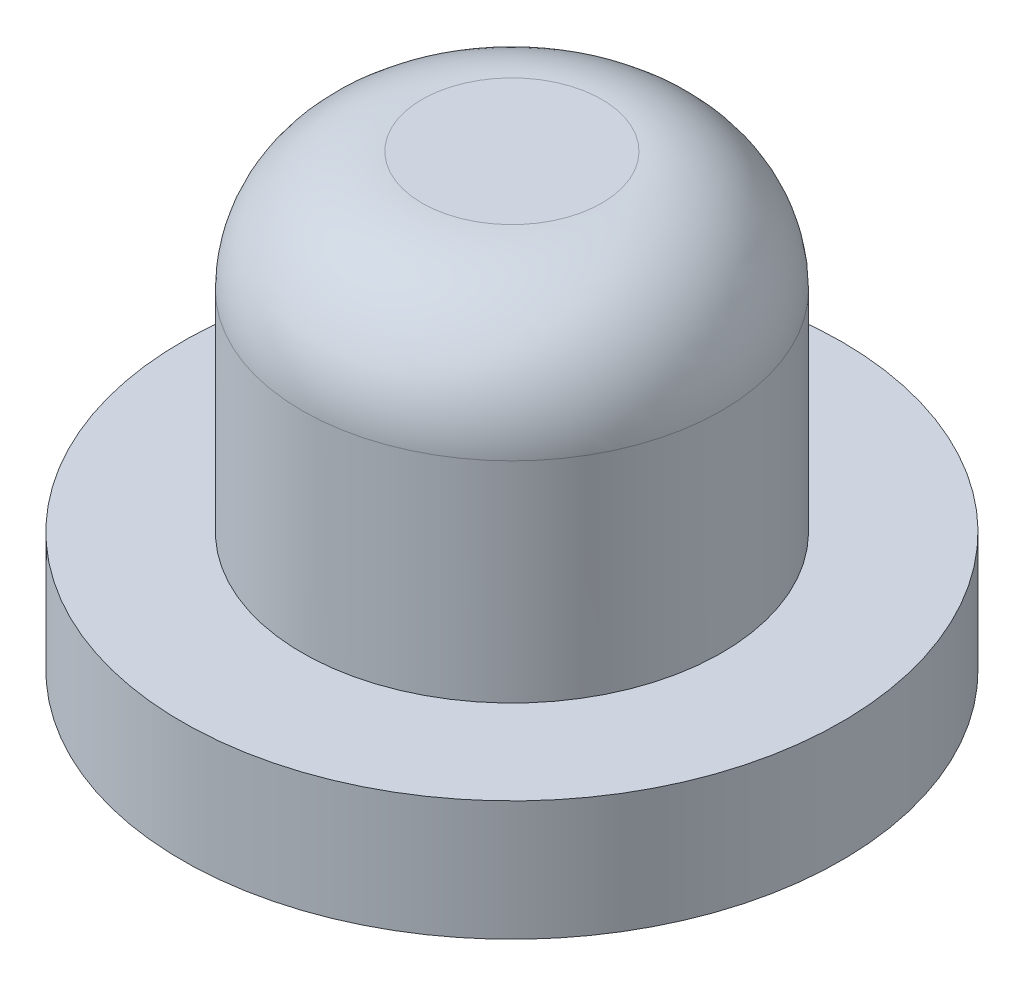
ISO-10303-21;
HEADER;
FILE_DESCRIPTION(('STEP AP214'),'2;1');
FILE_NAME('part.step','',(''),(''),'','','');
FILE_SCHEMA(('AUTOMOTIVE_DESIGN { 1 0 10303 214 1 1 1 1 }'));
ENDSEC;
DATA;
#1=APPLICATION_CONTEXT('core data for automotive mechanical design processes');
#2=APPLICATION_PROTOCOL_DEFINITION('international standard','automotive_design',2000,#1);
#3=PRODUCT_CONTEXT('',#1,'mechanical');
#4=PRODUCT('Part','Part','',(#3));
#5=PRODUCT_RELATED_PRODUCT_CATEGORY('part','',(#4));
#6=PRODUCT_DEFINITION_FORMATION('','',#4);
#7=PRODUCT_DEFINITION_CONTEXT('part definition',#1,'design');
#8=PRODUCT_DEFINITION('design','',#6,#7);
#9=PRODUCT_DEFINITION_SHAPE('','',#8);
#10=(LENGTH_UNIT() NAMED_UNIT(*) SI_UNIT(.MILLI.,.METRE.));
#11=(NAMED_UNIT(*) PLANE_ANGLE_UNIT() SI_UNIT($,.RADIAN.));
#12=(NAMED_UNIT(*) SI_UNIT($,.STERADIAN.) SOLID_ANGLE_UNIT());
#13=UNCERTAINTY_MEASURE_WITH_UNIT(LENGTH_MEASURE(1.E-05),#10,'distance_accuracy_value','');
#14=(GEOMETRIC_REPRESENTATION_CONTEXT(3) GLOBAL_UNCERTAINTY_ASSIGNED_CONTEXT((#13)) GLOBAL_UNIT_ASSIGNED_CONTEXT((#10,
#11,#12)) REPRESENTATION_CONTEXT('',''));
#15=CARTESIAN_POINT('',(0.,0.,0.));
#16=DIRECTION('',(0.,0.,1.));
#17=DIRECTION('',(1.,0.,0.));
#18=AXIS2_PLACEMENT_3D('',#15,#16,#17);
#19=CARTESIAN_POINT('',(0.,5.5,0.));
#20=DIRECTION('',(0.,-1.,0.));
#21=DIRECTION('',(0.,0.,-1.));
#22=AXIS2_PLACEMENT_3D('',#19,#20,#21);
#23=CYLINDRICAL_SURFACE('',#22,3.5);
#24=CARTESIAN_POINT('',(0.,3.5,0.));
#25=DIRECTION('',(0.,1.,0.));
#26=DIRECTION('',(0.,0.,1.));
#27=AXIS2_PLACEMENT_3D('',#24,#25,#26);
#28=CIRCLE('',#27,3.5);
#29=CARTESIAN_POINT('',(0.,3.5,3.5));
#30=VERTEX_POINT('',#29);
#31=EDGE_CURVE('E10',#30,#30,#28,.F.);
#32=ORIENTED_EDGE('',*,*,#31,.T.);
#33=EDGE_LOOP('',(#32));
#34=FACE_BOUND('',#33,.T.);
#35=CARTESIAN_POINT('',(0.,0.,0.));
#36=DIRECTION('',(0.,-1.,0.));
#37=DIRECTION('',(0.,0.,-1.));
#38=AXIS2_PLACEMENT_3D('',#35,#36,#37);
#39=CIRCLE('',#38,3.5);
#40=CARTESIAN_POINT('',(0.,0.,-3.5));
#41=VERTEX_POINT('',#40);
#42=EDGE_CURVE('E42',#41,#41,#39,.T.);
#43=ORIENTED_EDGE('',*,*,#42,.F.);
#44=EDGE_LOOP('',(#43));
#45=FACE_BOUND('',#44,.T.);
#46=ADVANCED_FACE('F31',(#34,#45),#23,.T.);
#47=CARTESIAN_POINT('',(0.,5.5,0.));
#48=DIRECTION('',(0.,1.,0.));
#49=DIRECTION('',(0.,0.,1.));
#50=AXIS2_PLACEMENT_3D('',#47,#48,#49);
#51=PLANE('',#50);
#52=CARTESIAN_POINT('',(0.,5.5,0.));
#53=DIRECTION('',(0.,1.,0.));
#54=DIRECTION('',(0.,0.,1.));
#55=AXIS2_PLACEMENT_3D('',#52,#53,#54);
#56=CIRCLE('',#55,1.5);
#57=CARTESIAN_POINT('',(0.,5.5,1.5));
#58=VERTEX_POINT('',#57);
#59=EDGE_CURVE('E38',#58,#58,#56,.T.);
#60=ORIENTED_EDGE('',*,*,#59,.T.);
#61=EDGE_LOOP('',(#60));
#62=FACE_BOUND('',#61,.T.);
#63=ADVANCED_FACE('F84',(#62),#51,.T.);
#64=CARTESIAN_POINT('',(0.,0.,0.));
#65=DIRECTION('',(0.,-1.,0.));
#66=DIRECTION('',(0.,0.,-1.));
#67=AXIS2_PLACEMENT_3D('',#64,#65,#66);
#68=PLANE('',#67);
#69=CARTESIAN_POINT('',(0.,0.,0.));
#70=DIRECTION('',(0.,-1.,0.));
#71=DIRECTION('',(0.,0.,-1.));
#72=AXIS2_PLACEMENT_3D('',#69,#70,#71);
#73=CIRCLE('',#72,5.5);
#74=CARTESIAN_POINT('',(0.,0.,-5.5));
#75=VERTEX_POINT('',#74);
#76=EDGE_CURVE('E49',#75,#75,#73,.T.);
#77=ORIENTED_EDGE('',*,*,#76,.F.);
#78=EDGE_LOOP('',(#77));
#79=FACE_BOUND('',#78,.T.);
#80=ORIENTED_EDGE('',*,*,#42,.T.);
#81=EDGE_LOOP('',(#80));
#82=FACE_BOUND('',#81,.T.);
#83=ADVANCED_FACE('F78',(#79,#82),#68,.F.);
#84=CARTESIAN_POINT('',(0.,-2.,0.));
#85=DIRECTION('',(0.,1.,0.));
#86=DIRECTION('',(0.,0.,1.));
#87=AXIS2_PLACEMENT_3D('',#84,#85,#86);
#88=CYLINDRICAL_SURFACE('',#87,5.5);
#89=CARTESIAN_POINT('',(0.,-2.,0.));
#90=DIRECTION('',(0.,-1.,0.));
#91=DIRECTION('',(0.,0.,-1.));
#92=AXIS2_PLACEMENT_3D('',#89,#90,#91);
#93=CIRCLE('',#92,5.5);
#94=CARTESIAN_POINT('',(0.,-2.,-5.5));
#95=VERTEX_POINT('',#94);
#96=EDGE_CURVE('E46',#95,#95,#93,.T.);
#97=ORIENTED_EDGE('',*,*,#96,.F.);
#98=EDGE_LOOP('',(#97));
#99=FACE_BOUND('',#98,.T.);
#100=ORIENTED_EDGE('',*,*,#76,.T.);
#101=EDGE_LOOP('',(#100));
#102=FACE_BOUND('',#101,.T.);
#103=ADVANCED_FACE('F72',(#99,#102),#88,.T.);
#104=CARTESIAN_POINT('',(0.,-2.,0.));
#105=DIRECTION('',(0.,-1.,0.));
#106=DIRECTION('',(0.,0.,-1.));
#107=AXIS2_PLACEMENT_3D('',#104,#105,#106);
#108=PLANE('',#107);
#109=CARTESIAN_POINT('',(0.,-2.,0.));
#110=DIRECTION('',(0.,-1.,0.));
#111=DIRECTION('',(0.,0.,-1.));
#112=AXIS2_PLACEMENT_3D('',#109,#110,#111);
#113=CIRCLE('',#112,2.);
#114=CARTESIAN_POINT('',(0.,-2.,-2.));
#115=VERTEX_POINT('',#114);
#116=EDGE_CURVE('E55',#115,#115,#113,.T.);
#117=ORIENTED_EDGE('',*,*,#116,.F.);
#118=EDGE_LOOP('',(#117));
#119=FACE_BOUND('',#118,.T.);
#120=ORIENTED_EDGE('',*,*,#96,.T.);
#121=EDGE_LOOP('',(#120));
#122=FACE_BOUND('',#121,.T.);
#123=ADVANCED_FACE('F66',(#119,#122),#108,.T.);
#124=CARTESIAN_POINT('',(0.,-1.5,0.));
#125=DIRECTION('',(0.,-1.,0.));
#126=DIRECTION('',(0.,0.,-1.));
#127=AXIS2_PLACEMENT_3D('',#124,#125,#126);
#128=CYLINDRICAL_SURFACE('',#127,2.);
#129=CARTESIAN_POINT('',(0.,-1.5,0.));
#130=DIRECTION('',(0.,-1.,0.));
#131=DIRECTION('',(0.,0.,-1.));
#132=AXIS2_PLACEMENT_3D('',#129,#130,#131);
#133=CIRCLE('',#132,2.);
#134=CARTESIAN_POINT('',(0.,-1.5,-2.));
#135=VERTEX_POINT('',#134);
#136=EDGE_CURVE('E52',#135,#135,#133,.T.);
#137=ORIENTED_EDGE('',*,*,#136,.F.);
#138=EDGE_LOOP('',(#137));
#139=FACE_BOUND('',#138,.T.);
#140=ORIENTED_EDGE('',*,*,#116,.T.);
#141=EDGE_LOOP('',(#140));
#142=FACE_BOUND('',#141,.T.);
#143=ADVANCED_FACE('F63',(#139,#142),#128,.F.);
#144=CARTESIAN_POINT('',(0.,-1.5,0.));
#145=DIRECTION('',(0.,-1.,0.));
#146=DIRECTION('',(0.,0.,-1.));
#147=AXIS2_PLACEMENT_3D('',#144,#145,#146);
#148=PLANE('',#147);
#149=ORIENTED_EDGE('',*,*,#136,.T.);
#150=EDGE_LOOP('',(#149));
#151=FACE_BOUND('',#150,.T.);
#152=ADVANCED_FACE('F61',(#151),#148,.T.);
#153=CARTESIAN_POINT('',(0.,3.5,0.));
#154=DIRECTION('',(0.,1.,0.));
#155=DIRECTION('',(0.,0.,1.));
#156=AXIS2_PLACEMENT_3D('',#153,#154,#155);
#157=DEGENERATE_TOROIDAL_SURFACE('',#156,1.5,2.,.T.);
#158=ORIENTED_EDGE('',*,*,#31,.F.);
#159=EDGE_LOOP('',(#158));
#160=FACE_BOUND('',#159,.T.);
#161=ORIENTED_EDGE('',*,*,#59,.F.);
#162=EDGE_LOOP('',(#161));
#163=FACE_BOUND('',#162,.T.);
#164=ADVANCED_FACE('F33',(#160,#163),#157,.T.);
#165=CLOSED_SHELL('',(#46,#63,#83,#103,#123,#143,#152,#164));
#166=MANIFOLD_SOLID_BREP('B2',#165);
#167=ADVANCED_BREP_SHAPE_REPRESENTATION('',(#18,#166),#14);
#168=SHAPE_DEFINITION_REPRESENTATION(#9,#167);
ENDSEC;
END-ISO-10303-21;
